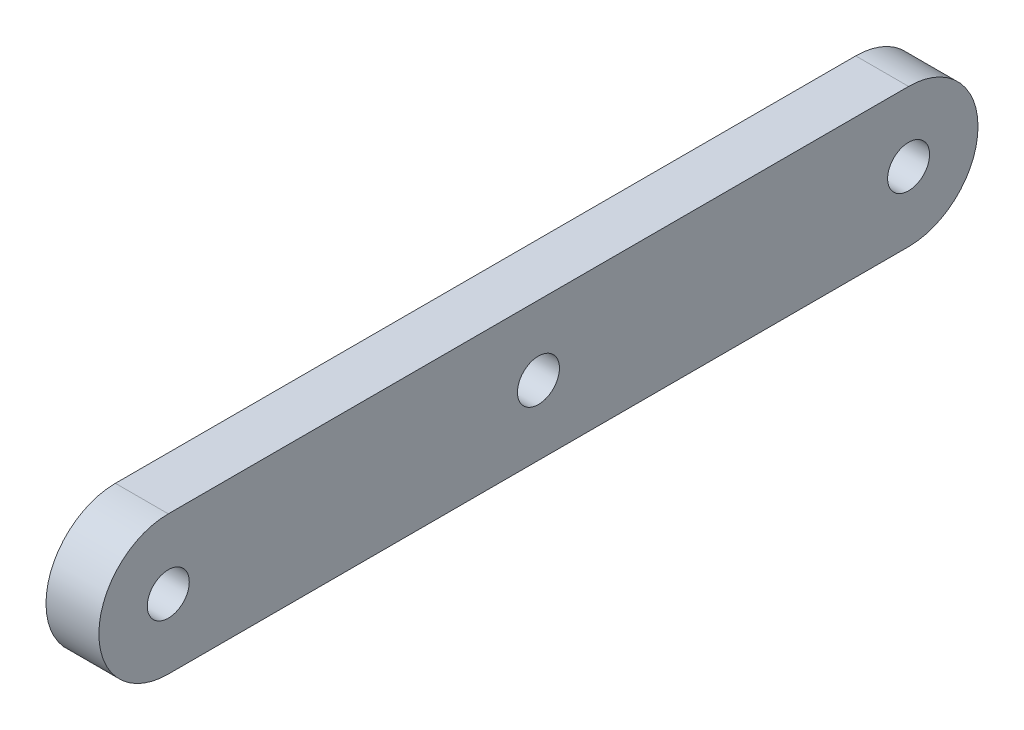
ISO-10303-21;
HEADER;
FILE_DESCRIPTION(('STEP AP214'),'2;1');
FILE_NAME('part.step','',(''),(''),'','','');
FILE_SCHEMA(('AUTOMOTIVE_DESIGN { 1 0 10303 214 1 1 1 1 }'));
ENDSEC;
DATA;
#1=APPLICATION_CONTEXT('core data for automotive mechanical design processes');
#2=APPLICATION_PROTOCOL_DEFINITION('international standard','automotive_design',2000,#1);
#3=PRODUCT_CONTEXT('',#1,'mechanical');
#4=PRODUCT('Part','Part','',(#3));
#5=PRODUCT_RELATED_PRODUCT_CATEGORY('part','',(#4));
#6=PRODUCT_DEFINITION_FORMATION('','',#4);
#7=PRODUCT_DEFINITION_CONTEXT('part definition',#1,'design');
#8=PRODUCT_DEFINITION('design','',#6,#7);
#9=PRODUCT_DEFINITION_SHAPE('','',#8);
#10=(LENGTH_UNIT() NAMED_UNIT(*) SI_UNIT(.MILLI.,.METRE.));
#11=(NAMED_UNIT(*) PLANE_ANGLE_UNIT() SI_UNIT($,.RADIAN.));
#12=(NAMED_UNIT(*) SI_UNIT($,.STERADIAN.) SOLID_ANGLE_UNIT());
#13=UNCERTAINTY_MEASURE_WITH_UNIT(LENGTH_MEASURE(1.E-05),#10,'distance_accuracy_value','');
#14=(GEOMETRIC_REPRESENTATION_CONTEXT(3) GLOBAL_UNCERTAINTY_ASSIGNED_CONTEXT((#13)) GLOBAL_UNIT_ASSIGNED_CONTEXT((#10,
#11,#12)) REPRESENTATION_CONTEXT('',''));
#15=CARTESIAN_POINT('',(0.,0.,0.));
#16=DIRECTION('',(0.,0.,1.));
#17=DIRECTION('',(1.,0.,0.));
#18=AXIS2_PLACEMENT_3D('',#15,#16,#17);
#19=CARTESIAN_POINT('',(12.7,16.66875,0.));
#20=DIRECTION('',(0.,1.,0.));
#21=DIRECTION('',(0.,0.,1.));
#22=AXIS2_PLACEMENT_3D('',#19,#20,#21);
#23=PLANE('',#22);
#24=DIRECTION('',(0.,0.,-1.));
#25=VECTOR('',#24,1.);
#26=CARTESIAN_POINT('',(0.,16.66875,0.));
#27=LINE('',#26,#25);
#28=CARTESIAN_POINT('',(0.,16.66875,88.9));
#29=VERTEX_POINT('',#28);
#30=CARTESIAN_POINT('',(0.,16.66875,-88.9));
#31=VERTEX_POINT('',#30);
#32=EDGE_CURVE('E98',#29,#31,#27,.T.);
#33=ORIENTED_EDGE('',*,*,#32,.F.);
#34=DIRECTION('',(-1.,0.,0.));
#35=VECTOR('',#34,1.);
#36=CARTESIAN_POINT('',(12.7,16.66875,88.9));
#37=LINE('',#36,#35);
#38=CARTESIAN_POINT('',(12.7,16.66875,88.9));
#39=VERTEX_POINT('',#38);
#40=EDGE_CURVE('E11',#39,#29,#37,.T.);
#41=ORIENTED_EDGE('',*,*,#40,.F.);
#42=DIRECTION('',(0.,0.,-1.));
#43=VECTOR('',#42,1.);
#44=CARTESIAN_POINT('',(12.7,16.66875,0.));
#45=LINE('',#44,#43);
#46=CARTESIAN_POINT('',(12.7,16.66875,-88.9));
#47=VERTEX_POINT('',#46);
#48=EDGE_CURVE('E83',#39,#47,#45,.T.);
#49=ORIENTED_EDGE('',*,*,#48,.T.);
#50=DIRECTION('',(-1.,0.,0.));
#51=VECTOR('',#50,1.);
#52=CARTESIAN_POINT('',(12.7,16.66875,-88.9));
#53=LINE('',#52,#51);
#54=EDGE_CURVE('E73',#47,#31,#53,.T.);
#55=ORIENTED_EDGE('',*,*,#54,.T.);
#56=EDGE_LOOP('',(#33,#41,#49,#55));
#57=FACE_BOUND('',#56,.T.);
#58=ADVANCED_FACE('F35',(#57),#23,.T.);
#59=CARTESIAN_POINT('',(12.7,0.,88.9));
#60=DIRECTION('',(-1.,0.,0.));
#61=DIRECTION('',(0.,0.,1.));
#62=AXIS2_PLACEMENT_3D('',#59,#60,#61);
#63=CYLINDRICAL_SURFACE('',#62,16.66875);
#64=CARTESIAN_POINT('',(0.,0.,88.9));
#65=DIRECTION('',(1.,0.,0.));
#66=DIRECTION('',(0.,0.,-1.));
#67=AXIS2_PLACEMENT_3D('',#64,#65,#66);
#68=CIRCLE('',#67,16.66875);
#69=CARTESIAN_POINT('',(0.,-16.66875,88.9));
#70=VERTEX_POINT('',#69);
#71=EDGE_CURVE('E89',#29,#70,#68,.T.);
#72=ORIENTED_EDGE('',*,*,#71,.T.);
#73=DIRECTION('',(-1.,0.,0.));
#74=VECTOR('',#73,1.);
#75=CARTESIAN_POINT('',(12.7,-16.66875,88.9));
#76=LINE('',#75,#74);
#77=CARTESIAN_POINT('',(12.7,-16.66875,88.9));
#78=VERTEX_POINT('',#77);
#79=EDGE_CURVE('E43',#78,#70,#76,.T.);
#80=ORIENTED_EDGE('',*,*,#79,.F.);
#81=CARTESIAN_POINT('',(12.7,0.,88.9));
#82=DIRECTION('',(1.,0.,0.));
#83=DIRECTION('',(0.,0.,-1.));
#84=AXIS2_PLACEMENT_3D('',#81,#82,#83);
#85=CIRCLE('',#84,16.66875);
#86=EDGE_CURVE('E78',#39,#78,#85,.T.);
#87=ORIENTED_EDGE('',*,*,#86,.F.);
#88=ORIENTED_EDGE('',*,*,#40,.T.);
#89=EDGE_LOOP('',(#72,#80,#87,#88));
#90=FACE_BOUND('',#89,.T.);
#91=ADVANCED_FACE('F87',(#90),#63,.T.);
#92=CARTESIAN_POINT('',(12.7,-16.66875,0.));
#93=DIRECTION('',(0.,-1.,0.));
#94=DIRECTION('',(0.,0.,-1.));
#95=AXIS2_PLACEMENT_3D('',#92,#93,#94);
#96=PLANE('',#95);
#97=DIRECTION('',(0.,0.,1.));
#98=VECTOR('',#97,1.);
#99=CARTESIAN_POINT('',(0.,-16.66875,0.));
#100=LINE('',#99,#98);
#101=CARTESIAN_POINT('',(0.,-16.66875,-88.9));
#102=VERTEX_POINT('',#101);
#103=EDGE_CURVE('E103',#102,#70,#100,.T.);
#104=ORIENTED_EDGE('',*,*,#103,.F.);
#105=DIRECTION('',(-1.,0.,0.));
#106=VECTOR('',#105,1.);
#107=CARTESIAN_POINT('',(12.7,-16.66875,-88.9));
#108=LINE('',#107,#106);
#109=CARTESIAN_POINT('',(12.7,-16.66875,-88.9));
#110=VERTEX_POINT('',#109);
#111=EDGE_CURVE('E66',#110,#102,#108,.T.);
#112=ORIENTED_EDGE('',*,*,#111,.F.);
#113=DIRECTION('',(0.,0.,1.));
#114=VECTOR('',#113,1.);
#115=CARTESIAN_POINT('',(12.7,-16.66875,0.));
#116=LINE('',#115,#114);
#117=EDGE_CURVE('E82',#110,#78,#116,.T.);
#118=ORIENTED_EDGE('',*,*,#117,.T.);
#119=ORIENTED_EDGE('',*,*,#79,.T.);
#120=EDGE_LOOP('',(#104,#112,#118,#119));
#121=FACE_BOUND('',#120,.T.);
#122=ADVANCED_FACE('F93',(#121),#96,.T.);
#123=CARTESIAN_POINT('',(12.7,0.,-88.9));
#124=DIRECTION('',(-1.,0.,0.));
#125=DIRECTION('',(0.,0.,1.));
#126=AXIS2_PLACEMENT_3D('',#123,#124,#125);
#127=CYLINDRICAL_SURFACE('',#126,16.66875);
#128=CARTESIAN_POINT('',(0.,0.,-88.9));
#129=DIRECTION('',(1.,0.,0.));
#130=DIRECTION('',(0.,0.,-1.));
#131=AXIS2_PLACEMENT_3D('',#128,#129,#130);
#132=CIRCLE('',#131,16.66875);
#133=EDGE_CURVE('E105',#102,#31,#132,.T.);
#134=ORIENTED_EDGE('',*,*,#133,.T.);
#135=ORIENTED_EDGE('',*,*,#54,.F.);
#136=CARTESIAN_POINT('',(12.7,0.,-88.9));
#137=DIRECTION('',(1.,0.,0.));
#138=DIRECTION('',(0.,0.,-1.));
#139=AXIS2_PLACEMENT_3D('',#136,#137,#138);
#140=CIRCLE('',#139,16.66875);
#141=EDGE_CURVE('E51',#110,#47,#140,.T.);
#142=ORIENTED_EDGE('',*,*,#141,.F.);
#143=ORIENTED_EDGE('',*,*,#111,.T.);
#144=EDGE_LOOP('',(#134,#135,#142,#143));
#145=FACE_BOUND('',#144,.T.);
#146=ADVANCED_FACE('F132',(#145),#127,.T.);
#147=CARTESIAN_POINT('',(12.7,0.,0.));
#148=DIRECTION('',(1.,0.,0.));
#149=DIRECTION('',(0.,0.,-1.));
#150=AXIS2_PLACEMENT_3D('',#147,#148,#149);
#151=PLANE('',#150);
#152=CARTESIAN_POINT('',(12.7,0.,0.));
#153=DIRECTION('',(1.,0.,0.));
#154=DIRECTION('',(0.,0.,-1.));
#155=AXIS2_PLACEMENT_3D('',#152,#153,#154);
#156=CIRCLE('',#155,5.04189999999999);
#157=CARTESIAN_POINT('',(12.7,0.,-5.04189999999999));
#158=VERTEX_POINT('',#157);
#159=EDGE_CURVE('E123',#158,#158,#156,.T.);
#160=ORIENTED_EDGE('',*,*,#159,.F.);
#161=EDGE_LOOP('',(#160));
#162=FACE_BOUND('',#161,.T.);
#163=CARTESIAN_POINT('',(12.7,0.,-88.9));
#164=DIRECTION('',(1.,0.,0.));
#165=DIRECTION('',(0.,0.,-1.));
#166=AXIS2_PLACEMENT_3D('',#163,#164,#165);
#167=CIRCLE('',#166,5.04189999999999);
#168=CARTESIAN_POINT('',(12.7,0.,-93.9419));
#169=VERTEX_POINT('',#168);
#170=EDGE_CURVE('E117',#169,#169,#167,.T.);
#171=ORIENTED_EDGE('',*,*,#170,.F.);
#172=EDGE_LOOP('',(#171));
#173=FACE_BOUND('',#172,.T.);
#174=CARTESIAN_POINT('',(12.7,0.,88.9));
#175=DIRECTION('',(1.,0.,0.));
#176=DIRECTION('',(0.,0.,-1.));
#177=AXIS2_PLACEMENT_3D('',#174,#175,#176);
#178=CIRCLE('',#177,5.04189999999999);
#179=CARTESIAN_POINT('',(12.7,0.,83.8581));
#180=VERTEX_POINT('',#179);
#181=EDGE_CURVE('E111',#180,#180,#178,.T.);
#182=ORIENTED_EDGE('',*,*,#181,.F.);
#183=EDGE_LOOP('',(#182));
#184=FACE_BOUND('',#183,.T.);
#185=ORIENTED_EDGE('',*,*,#48,.F.);
#186=ORIENTED_EDGE('',*,*,#86,.T.);
#187=ORIENTED_EDGE('',*,*,#117,.F.);
#188=ORIENTED_EDGE('',*,*,#141,.T.);
#189=EDGE_LOOP('',(#185,#186,#187,#188));
#190=FACE_BOUND('',#189,.T.);
#191=ADVANCED_FACE('F80',(#162,#173,#184,#190),#151,.T.);
#192=CARTESIAN_POINT('',(0.,0.,0.));
#193=DIRECTION('',(1.,0.,0.));
#194=DIRECTION('',(0.,0.,-1.));
#195=AXIS2_PLACEMENT_3D('',#192,#193,#194);
#196=PLANE('',#195);
#197=CARTESIAN_POINT('',(0.,0.,0.));
#198=DIRECTION('',(1.,0.,0.));
#199=DIRECTION('',(0.,0.,-1.));
#200=AXIS2_PLACEMENT_3D('',#197,#198,#199);
#201=CIRCLE('',#200,5.04189999999999);
#202=CARTESIAN_POINT('',(0.,0.,-5.04189999999999));
#203=VERTEX_POINT('',#202);
#204=EDGE_CURVE('E120',#203,#203,#201,.T.);
#205=ORIENTED_EDGE('',*,*,#204,.T.);
#206=EDGE_LOOP('',(#205));
#207=FACE_BOUND('',#206,.T.);
#208=CARTESIAN_POINT('',(0.,0.,-88.9));
#209=DIRECTION('',(1.,0.,0.));
#210=DIRECTION('',(0.,0.,-1.));
#211=AXIS2_PLACEMENT_3D('',#208,#209,#210);
#212=CIRCLE('',#211,5.04189999999999);
#213=CARTESIAN_POINT('',(0.,0.,-93.9419));
#214=VERTEX_POINT('',#213);
#215=EDGE_CURVE('E114',#214,#214,#212,.T.);
#216=ORIENTED_EDGE('',*,*,#215,.T.);
#217=EDGE_LOOP('',(#216));
#218=FACE_BOUND('',#217,.T.);
#219=CARTESIAN_POINT('',(0.,0.,88.9));
#220=DIRECTION('',(1.,0.,0.));
#221=DIRECTION('',(0.,0.,-1.));
#222=AXIS2_PLACEMENT_3D('',#219,#220,#221);
#223=CIRCLE('',#222,5.04189999999999);
#224=CARTESIAN_POINT('',(0.,0.,83.8581));
#225=VERTEX_POINT('',#224);
#226=EDGE_CURVE('E101',#225,#225,#223,.T.);
#227=ORIENTED_EDGE('',*,*,#226,.T.);
#228=EDGE_LOOP('',(#227));
#229=FACE_BOUND('',#228,.T.);
#230=ORIENTED_EDGE('',*,*,#32,.T.);
#231=ORIENTED_EDGE('',*,*,#133,.F.);
#232=ORIENTED_EDGE('',*,*,#103,.T.);
#233=ORIENTED_EDGE('',*,*,#71,.F.);
#234=EDGE_LOOP('',(#230,#231,#232,#233));
#235=FACE_BOUND('',#234,.T.);
#236=ADVANCED_FACE('F131',(#207,#218,#229,#235),#196,.F.);
#237=CARTESIAN_POINT('',(12.7,0.,88.9));
#238=DIRECTION('',(1.,0.,0.));
#239=DIRECTION('',(0.,0.,-1.));
#240=AXIS2_PLACEMENT_3D('',#237,#238,#239);
#241=CYLINDRICAL_SURFACE('',#240,5.04189999999999);
#242=ORIENTED_EDGE('',*,*,#226,.F.);
#243=EDGE_LOOP('',(#242));
#244=FACE_BOUND('',#243,.T.);
#245=ORIENTED_EDGE('',*,*,#181,.T.);
#246=EDGE_LOOP('',(#245));
#247=FACE_BOUND('',#246,.T.);
#248=ADVANCED_FACE('F138',(#244,#247),#241,.F.);
#249=CARTESIAN_POINT('',(12.7,0.,-88.9));
#250=DIRECTION('',(1.,0.,0.));
#251=DIRECTION('',(0.,0.,-1.));
#252=AXIS2_PLACEMENT_3D('',#249,#250,#251);
#253=CYLINDRICAL_SURFACE('',#252,5.04189999999999);
#254=ORIENTED_EDGE('',*,*,#215,.F.);
#255=EDGE_LOOP('',(#254));
#256=FACE_BOUND('',#255,.T.);
#257=ORIENTED_EDGE('',*,*,#170,.T.);
#258=EDGE_LOOP('',(#257));
#259=FACE_BOUND('',#258,.T.);
#260=ADVANCED_FACE('F140',(#256,#259),#253,.F.);
#261=CARTESIAN_POINT('',(12.7,0.,0.));
#262=DIRECTION('',(1.,0.,0.));
#263=DIRECTION('',(0.,0.,-1.));
#264=AXIS2_PLACEMENT_3D('',#261,#262,#263);
#265=CYLINDRICAL_SURFACE('',#264,5.04189999999999);
#266=ORIENTED_EDGE('',*,*,#204,.F.);
#267=EDGE_LOOP('',(#266));
#268=FACE_BOUND('',#267,.T.);
#269=ORIENTED_EDGE('',*,*,#159,.T.);
#270=EDGE_LOOP('',(#269));
#271=FACE_BOUND('',#270,.T.);
#272=ADVANCED_FACE('F127',(#268,#271),#265,.F.);
#273=CLOSED_SHELL('',(#58,#91,#122,#146,#191,#236,#248,#260,#272));
#274=MANIFOLD_SOLID_BREP('B2',#273);
#275=ADVANCED_BREP_SHAPE_REPRESENTATION('',(#18,#274),#14);
#276=SHAPE_DEFINITION_REPRESENTATION(#9,#275);
ENDSEC;
END-ISO-10303-21;
